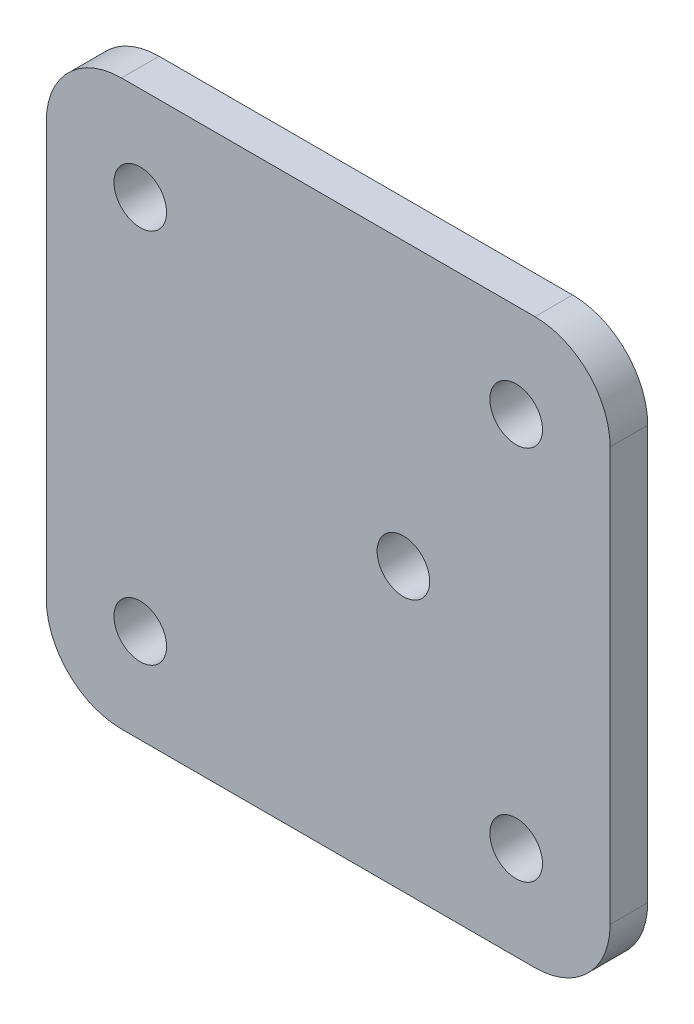
ISO-10303-21;
HEADER;
FILE_DESCRIPTION(('STEP AP214'),'2;1');
FILE_NAME('part.step','',(''),(''),'','','');
FILE_SCHEMA(('AUTOMOTIVE_DESIGN { 1 0 10303 214 1 1 1 1 }'));
ENDSEC;
DATA;
#1=APPLICATION_CONTEXT('core data for automotive mechanical design processes');
#2=APPLICATION_PROTOCOL_DEFINITION('international standard','automotive_design',2000,#1);
#3=PRODUCT_CONTEXT('',#1,'mechanical');
#4=PRODUCT('Part','Part','',(#3));
#5=PRODUCT_RELATED_PRODUCT_CATEGORY('part','',(#4));
#6=PRODUCT_DEFINITION_FORMATION('','',#4);
#7=PRODUCT_DEFINITION_CONTEXT('part definition',#1,'design');
#8=PRODUCT_DEFINITION('design','',#6,#7);
#9=PRODUCT_DEFINITION_SHAPE('','',#8);
#10=(LENGTH_UNIT() NAMED_UNIT(*) SI_UNIT(.MILLI.,.METRE.));
#11=(NAMED_UNIT(*) PLANE_ANGLE_UNIT() SI_UNIT($,.RADIAN.));
#12=(NAMED_UNIT(*) SI_UNIT($,.STERADIAN.) SOLID_ANGLE_UNIT());
#13=UNCERTAINTY_MEASURE_WITH_UNIT(LENGTH_MEASURE(1.E-05),#10,'distance_accuracy_value','');
#14=(GEOMETRIC_REPRESENTATION_CONTEXT(3) GLOBAL_UNCERTAINTY_ASSIGNED_CONTEXT((#13)) GLOBAL_UNIT_ASSIGNED_CONTEXT((#10,
#11,#12)) REPRESENTATION_CONTEXT('',''));
#15=CARTESIAN_POINT('',(0.,0.,0.));
#16=DIRECTION('',(0.,0.,1.));
#17=DIRECTION('',(1.,0.,0.));
#18=AXIS2_PLACEMENT_3D('',#15,#16,#17);
#19=CARTESIAN_POINT('',(-37.5,37.5,5.));
#20=DIRECTION('',(1.,0.,0.));
#21=DIRECTION('',(0.,1.,0.));
#22=AXIS2_PLACEMENT_3D('',#19,#20,#21);
#23=PLANE('',#22);
#24=DIRECTION('',(0.,-1.,0.));
#25=VECTOR('',#24,1.);
#26=CARTESIAN_POINT('',(-37.5,37.5,5.));
#27=LINE('',#26,#25);
#28=CARTESIAN_POINT('',(-37.5,27.5,5.));
#29=VERTEX_POINT('',#28);
#30=CARTESIAN_POINT('',(-37.5,-27.5,5.));
#31=VERTEX_POINT('',#30);
#32=EDGE_CURVE('E121',#29,#31,#27,.T.);
#33=ORIENTED_EDGE('',*,*,#32,.F.);
#34=DIRECTION('',(0.,0.,-1.));
#35=VECTOR('',#34,1.);
#36=CARTESIAN_POINT('',(-37.5,27.5,5.));
#37=LINE('',#36,#35);
#38=CARTESIAN_POINT('',(-37.5,27.5,0.));
#39=VERTEX_POINT('',#38);
#40=EDGE_CURVE('E106',#29,#39,#37,.T.);
#41=ORIENTED_EDGE('',*,*,#40,.T.);
#42=DIRECTION('',(0.,-1.,0.));
#43=VECTOR('',#42,1.);
#44=CARTESIAN_POINT('',(-37.5,37.5,0.));
#45=LINE('',#44,#43);
#46=CARTESIAN_POINT('',(-37.5,-27.5,0.));
#47=VERTEX_POINT('',#46);
#48=EDGE_CURVE('E118',#39,#47,#45,.T.);
#49=ORIENTED_EDGE('',*,*,#48,.T.);
#50=DIRECTION('',(0.,0.,-1.));
#51=VECTOR('',#50,1.);
#52=CARTESIAN_POINT('',(-37.5,-27.5,5.));
#53=LINE('',#52,#51);
#54=EDGE_CURVE('E123',#47,#31,#53,.F.);
#55=ORIENTED_EDGE('',*,*,#54,.T.);
#56=EDGE_LOOP('',(#33,#41,#49,#55));
#57=FACE_BOUND('',#56,.T.);
#58=ADVANCED_FACE('F36',(#57),#23,.F.);
#59=CARTESIAN_POINT('',(-37.5,-37.5,5.));
#60=DIRECTION('',(0.,1.,0.));
#61=DIRECTION('',(-1.,0.,0.));
#62=AXIS2_PLACEMENT_3D('',#59,#60,#61);
#63=PLANE('',#62);
#64=DIRECTION('',(1.,0.,0.));
#65=VECTOR('',#64,1.);
#66=CARTESIAN_POINT('',(-37.5,-37.5,5.));
#67=LINE('',#66,#65);
#68=CARTESIAN_POINT('',(-27.5,-37.5,5.));
#69=VERTEX_POINT('',#68);
#70=CARTESIAN_POINT('',(27.5,-37.5,5.));
#71=VERTEX_POINT('',#70);
#72=EDGE_CURVE('E167',#69,#71,#67,.T.);
#73=ORIENTED_EDGE('',*,*,#72,.F.);
#74=DIRECTION('',(0.,0.,-1.));
#75=VECTOR('',#74,1.);
#76=CARTESIAN_POINT('',(-27.5,-37.5,5.));
#77=LINE('',#76,#75);
#78=CARTESIAN_POINT('',(-27.5,-37.5,0.));
#79=VERTEX_POINT('',#78);
#80=EDGE_CURVE('E160',#69,#79,#77,.T.);
#81=ORIENTED_EDGE('',*,*,#80,.T.);
#82=DIRECTION('',(1.,0.,0.));
#83=VECTOR('',#82,1.);
#84=CARTESIAN_POINT('',(-37.5,-37.5,0.));
#85=LINE('',#84,#83);
#86=CARTESIAN_POINT('',(27.5,-37.5,0.));
#87=VERTEX_POINT('',#86);
#88=EDGE_CURVE('E127',#79,#87,#85,.T.);
#89=ORIENTED_EDGE('',*,*,#88,.T.);
#90=DIRECTION('',(0.,0.,-1.));
#91=VECTOR('',#90,1.);
#92=CARTESIAN_POINT('',(27.5,-37.5,5.));
#93=LINE('',#92,#91);
#94=EDGE_CURVE('E158',#87,#71,#93,.F.);
#95=ORIENTED_EDGE('',*,*,#94,.T.);
#96=EDGE_LOOP('',(#73,#81,#89,#95));
#97=FACE_BOUND('',#96,.T.);
#98=ADVANCED_FACE('F165',(#97),#63,.F.);
#99=CARTESIAN_POINT('',(37.5,37.5,5.));
#100=DIRECTION('',(-1.,0.,0.));
#101=DIRECTION('',(0.,0.,1.));
#102=AXIS2_PLACEMENT_3D('',#99,#100,#101);
#103=PLANE('',#102);
#104=DIRECTION('',(0.,1.,0.));
#105=VECTOR('',#104,1.);
#106=CARTESIAN_POINT('',(37.5,37.5,5.));
#107=LINE('',#106,#105);
#108=CARTESIAN_POINT('',(37.5,-27.5,5.));
#109=VERTEX_POINT('',#108);
#110=CARTESIAN_POINT('',(37.5,27.5,5.));
#111=VERTEX_POINT('',#110);
#112=EDGE_CURVE('E175',#109,#111,#107,.T.);
#113=ORIENTED_EDGE('',*,*,#112,.F.);
#114=DIRECTION('',(0.,0.,-1.));
#115=VECTOR('',#114,1.);
#116=CARTESIAN_POINT('',(37.5,-27.5,5.));
#117=LINE('',#116,#115);
#118=CARTESIAN_POINT('',(37.5,-27.5,0.));
#119=VERTEX_POINT('',#118);
#120=EDGE_CURVE('E11',#109,#119,#117,.T.);
#121=ORIENTED_EDGE('',*,*,#120,.T.);
#122=DIRECTION('',(0.,1.,0.));
#123=VECTOR('',#122,1.);
#124=CARTESIAN_POINT('',(37.5,37.5,0.));
#125=LINE('',#124,#123);
#126=CARTESIAN_POINT('',(37.5,27.5,0.));
#127=VERTEX_POINT('',#126);
#128=EDGE_CURVE('E131',#119,#127,#125,.T.);
#129=ORIENTED_EDGE('',*,*,#128,.T.);
#130=DIRECTION('',(0.,0.,-1.));
#131=VECTOR('',#130,1.);
#132=CARTESIAN_POINT('',(37.5,27.5,5.));
#133=LINE('',#132,#131);
#134=EDGE_CURVE('E44',#127,#111,#133,.F.);
#135=ORIENTED_EDGE('',*,*,#134,.T.);
#136=EDGE_LOOP('',(#113,#121,#129,#135));
#137=FACE_BOUND('',#136,.T.);
#138=ADVANCED_FACE('F174',(#137),#103,.F.);
#139=CARTESIAN_POINT('',(-37.5,37.5,5.));
#140=DIRECTION('',(0.,-1.,0.));
#141=DIRECTION('',(1.,0.,0.));
#142=AXIS2_PLACEMENT_3D('',#139,#140,#141);
#143=PLANE('',#142);
#144=DIRECTION('',(-1.,0.,0.));
#145=VECTOR('',#144,1.);
#146=CARTESIAN_POINT('',(-37.5,37.5,0.));
#147=LINE('',#146,#145);
#148=CARTESIAN_POINT('',(27.5,37.5,0.));
#149=VERTEX_POINT('',#148);
#150=CARTESIAN_POINT('',(-27.5,37.5,0.));
#151=VERTEX_POINT('',#150);
#152=EDGE_CURVE('E141',#149,#151,#147,.T.);
#153=ORIENTED_EDGE('',*,*,#152,.T.);
#154=DIRECTION('',(0.,0.,-1.));
#155=VECTOR('',#154,1.);
#156=CARTESIAN_POINT('',(-27.5,37.5,5.));
#157=LINE('',#156,#155);
#158=CARTESIAN_POINT('',(-27.5,37.5,5.));
#159=VERTEX_POINT('',#158);
#160=EDGE_CURVE('E107',#151,#159,#157,.F.);
#161=ORIENTED_EDGE('',*,*,#160,.T.);
#162=DIRECTION('',(-1.,0.,0.));
#163=VECTOR('',#162,1.);
#164=CARTESIAN_POINT('',(-37.5,37.5,5.));
#165=LINE('',#164,#163);
#166=CARTESIAN_POINT('',(27.5,37.5,5.));
#167=VERTEX_POINT('',#166);
#168=EDGE_CURVE('E137',#167,#159,#165,.T.);
#169=ORIENTED_EDGE('',*,*,#168,.F.);
#170=DIRECTION('',(0.,0.,-1.));
#171=VECTOR('',#170,1.);
#172=CARTESIAN_POINT('',(27.5,37.5,5.));
#173=LINE('',#172,#171);
#174=EDGE_CURVE('E112',#167,#149,#173,.T.);
#175=ORIENTED_EDGE('',*,*,#174,.T.);
#176=EDGE_LOOP('',(#153,#161,#169,#175));
#177=FACE_BOUND('',#176,.T.);
#178=ADVANCED_FACE('F213',(#177),#143,.F.);
#179=CARTESIAN_POINT('',(0.,0.,5.));
#180=DIRECTION('',(0.,0.,1.));
#181=DIRECTION('',(1.,0.,0.));
#182=AXIS2_PLACEMENT_3D('',#179,#180,#181);
#183=PLANE('',#182);
#184=CARTESIAN_POINT('',(10.,0.,5.));
#185=DIRECTION('',(0.,0.,1.));
#186=DIRECTION('',(1.,0.,0.));
#187=AXIS2_PLACEMENT_3D('',#184,#185,#186);
#188=CIRCLE('',#187,3.5);
#189=CARTESIAN_POINT('',(13.5,0.,5.));
#190=VERTEX_POINT('',#189);
#191=EDGE_CURVE('E204',#190,#190,#188,.T.);
#192=ORIENTED_EDGE('',*,*,#191,.F.);
#193=EDGE_LOOP('',(#192));
#194=FACE_BOUND('',#193,.T.);
#195=CARTESIAN_POINT('',(-25.,25.,5.));
#196=DIRECTION('',(0.,0.,1.));
#197=DIRECTION('',(1.,0.,0.));
#198=AXIS2_PLACEMENT_3D('',#195,#196,#197);
#199=CIRCLE('',#198,3.5);
#200=CARTESIAN_POINT('',(-21.5,25.,5.));
#201=VERTEX_POINT('',#200);
#202=EDGE_CURVE('E198',#201,#201,#199,.T.);
#203=ORIENTED_EDGE('',*,*,#202,.F.);
#204=EDGE_LOOP('',(#203));
#205=FACE_BOUND('',#204,.T.);
#206=CARTESIAN_POINT('',(-25.,-25.,5.));
#207=DIRECTION('',(0.,0.,1.));
#208=DIRECTION('',(1.,0.,0.));
#209=AXIS2_PLACEMENT_3D('',#206,#207,#208);
#210=CIRCLE('',#209,3.5);
#211=CARTESIAN_POINT('',(-21.5,-25.,5.));
#212=VERTEX_POINT('',#211);
#213=EDGE_CURVE('E192',#212,#212,#210,.T.);
#214=ORIENTED_EDGE('',*,*,#213,.F.);
#215=EDGE_LOOP('',(#214));
#216=FACE_BOUND('',#215,.T.);
#217=CARTESIAN_POINT('',(25.,-25.,5.));
#218=DIRECTION('',(0.,0.,1.));
#219=DIRECTION('',(1.,0.,0.));
#220=AXIS2_PLACEMENT_3D('',#217,#218,#219);
#221=CIRCLE('',#220,3.5);
#222=CARTESIAN_POINT('',(28.5,-25.,5.));
#223=VERTEX_POINT('',#222);
#224=EDGE_CURVE('E186',#223,#223,#221,.T.);
#225=ORIENTED_EDGE('',*,*,#224,.F.);
#226=EDGE_LOOP('',(#225));
#227=FACE_BOUND('',#226,.T.);
#228=CARTESIAN_POINT('',(25.,25.,5.));
#229=DIRECTION('',(0.,0.,1.));
#230=DIRECTION('',(1.,0.,0.));
#231=AXIS2_PLACEMENT_3D('',#228,#229,#230);
#232=CIRCLE('',#231,3.5);
#233=CARTESIAN_POINT('',(28.5,25.,5.));
#234=VERTEX_POINT('',#233);
#235=EDGE_CURVE('E134',#234,#234,#232,.T.);
#236=ORIENTED_EDGE('',*,*,#235,.F.);
#237=EDGE_LOOP('',(#236));
#238=FACE_BOUND('',#237,.T.);
#239=ORIENTED_EDGE('',*,*,#168,.T.);
#240=CARTESIAN_POINT('',(-27.5,27.5,5.));
#241=DIRECTION('',(0.,0.,1.));
#242=DIRECTION('',(1.,0.,0.));
#243=AXIS2_PLACEMENT_3D('',#240,#241,#242);
#244=CIRCLE('',#243,10.);
#245=EDGE_CURVE('E156',#159,#29,#244,.T.);
#246=ORIENTED_EDGE('',*,*,#245,.T.);
#247=ORIENTED_EDGE('',*,*,#32,.T.);
#248=CARTESIAN_POINT('',(-27.5,-27.5,5.));
#249=DIRECTION('',(0.,0.,1.));
#250=DIRECTION('',(1.,0.,0.));
#251=AXIS2_PLACEMENT_3D('',#248,#249,#250);
#252=CIRCLE('',#251,10.);
#253=EDGE_CURVE('E154',#31,#69,#252,.T.);
#254=ORIENTED_EDGE('',*,*,#253,.T.);
#255=ORIENTED_EDGE('',*,*,#72,.T.);
#256=CARTESIAN_POINT('',(27.5,-27.5,5.));
#257=DIRECTION('',(0.,0.,1.));
#258=DIRECTION('',(1.,0.,0.));
#259=AXIS2_PLACEMENT_3D('',#256,#257,#258);
#260=CIRCLE('',#259,10.);
#261=EDGE_CURVE('E57',#71,#109,#260,.T.);
#262=ORIENTED_EDGE('',*,*,#261,.T.);
#263=ORIENTED_EDGE('',*,*,#112,.T.);
#264=CARTESIAN_POINT('',(27.5,27.5,5.));
#265=DIRECTION('',(0.,0.,1.));
#266=DIRECTION('',(1.,0.,0.));
#267=AXIS2_PLACEMENT_3D('',#264,#265,#266);
#268=CIRCLE('',#267,10.);
#269=EDGE_CURVE('E151',#111,#167,#268,.T.);
#270=ORIENTED_EDGE('',*,*,#269,.T.);
#271=EDGE_LOOP('',(#239,#246,#247,#254,#255,#262,#263,#270));
#272=FACE_BOUND('',#271,.T.);
#273=ADVANCED_FACE('F210',(#194,#205,#216,#227,#238,#272),#183,.T.);
#274=CARTESIAN_POINT('',(0.,0.,0.));
#275=DIRECTION('',(0.,0.,1.));
#276=DIRECTION('',(1.,0.,0.));
#277=AXIS2_PLACEMENT_3D('',#274,#275,#276);
#278=PLANE('',#277);
#279=CARTESIAN_POINT('',(10.,0.,0.));
#280=DIRECTION('',(0.,0.,1.));
#281=DIRECTION('',(1.,0.,0.));
#282=AXIS2_PLACEMENT_3D('',#279,#280,#281);
#283=CIRCLE('',#282,3.5);
#284=CARTESIAN_POINT('',(13.5,0.,0.));
#285=VERTEX_POINT('',#284);
#286=EDGE_CURVE('E201',#285,#285,#283,.T.);
#287=ORIENTED_EDGE('',*,*,#286,.T.);
#288=EDGE_LOOP('',(#287));
#289=FACE_BOUND('',#288,.T.);
#290=CARTESIAN_POINT('',(-25.,25.,0.));
#291=DIRECTION('',(0.,0.,1.));
#292=DIRECTION('',(1.,0.,0.));
#293=AXIS2_PLACEMENT_3D('',#290,#291,#292);
#294=CIRCLE('',#293,3.5);
#295=CARTESIAN_POINT('',(-21.5,25.,0.));
#296=VERTEX_POINT('',#295);
#297=EDGE_CURVE('E195',#296,#296,#294,.T.);
#298=ORIENTED_EDGE('',*,*,#297,.T.);
#299=EDGE_LOOP('',(#298));
#300=FACE_BOUND('',#299,.T.);
#301=CARTESIAN_POINT('',(-25.,-25.,0.));
#302=DIRECTION('',(0.,0.,1.));
#303=DIRECTION('',(1.,0.,0.));
#304=AXIS2_PLACEMENT_3D('',#301,#302,#303);
#305=CIRCLE('',#304,3.5);
#306=CARTESIAN_POINT('',(-21.5,-25.,0.));
#307=VERTEX_POINT('',#306);
#308=EDGE_CURVE('E189',#307,#307,#305,.T.);
#309=ORIENTED_EDGE('',*,*,#308,.T.);
#310=EDGE_LOOP('',(#309));
#311=FACE_BOUND('',#310,.T.);
#312=CARTESIAN_POINT('',(25.,-25.,0.));
#313=DIRECTION('',(0.,0.,1.));
#314=DIRECTION('',(1.,0.,0.));
#315=AXIS2_PLACEMENT_3D('',#312,#313,#314);
#316=CIRCLE('',#315,3.5);
#317=CARTESIAN_POINT('',(28.5,-25.,0.));
#318=VERTEX_POINT('',#317);
#319=EDGE_CURVE('E183',#318,#318,#316,.T.);
#320=ORIENTED_EDGE('',*,*,#319,.T.);
#321=EDGE_LOOP('',(#320));
#322=FACE_BOUND('',#321,.T.);
#323=CARTESIAN_POINT('',(25.,25.,0.));
#324=DIRECTION('',(0.,0.,1.));
#325=DIRECTION('',(1.,0.,0.));
#326=AXIS2_PLACEMENT_3D('',#323,#324,#325);
#327=CIRCLE('',#326,3.5);
#328=CARTESIAN_POINT('',(28.5,25.,0.));
#329=VERTEX_POINT('',#328);
#330=EDGE_CURVE('E128',#329,#329,#327,.T.);
#331=ORIENTED_EDGE('',*,*,#330,.T.);
#332=EDGE_LOOP('',(#331));
#333=FACE_BOUND('',#332,.T.);
#334=ORIENTED_EDGE('',*,*,#48,.F.);
#335=CARTESIAN_POINT('',(-27.5,27.5,0.));
#336=DIRECTION('',(0.,0.,1.));
#337=DIRECTION('',(1.,0.,0.));
#338=AXIS2_PLACEMENT_3D('',#335,#336,#337);
#339=CIRCLE('',#338,10.);
#340=EDGE_CURVE('E102',#39,#151,#339,.F.);
#341=ORIENTED_EDGE('',*,*,#340,.T.);
#342=ORIENTED_EDGE('',*,*,#152,.F.);
#343=CARTESIAN_POINT('',(27.5,27.5,0.));
#344=DIRECTION('',(0.,0.,1.));
#345=DIRECTION('',(1.,0.,0.));
#346=AXIS2_PLACEMENT_3D('',#343,#344,#345);
#347=CIRCLE('',#346,10.);
#348=EDGE_CURVE('E122',#149,#127,#347,.F.);
#349=ORIENTED_EDGE('',*,*,#348,.T.);
#350=ORIENTED_EDGE('',*,*,#128,.F.);
#351=CARTESIAN_POINT('',(27.5,-27.5,0.));
#352=DIRECTION('',(0.,0.,1.));
#353=DIRECTION('',(1.,0.,0.));
#354=AXIS2_PLACEMENT_3D('',#351,#352,#353);
#355=CIRCLE('',#354,10.);
#356=EDGE_CURVE('E145',#119,#87,#355,.F.);
#357=ORIENTED_EDGE('',*,*,#356,.T.);
#358=ORIENTED_EDGE('',*,*,#88,.F.);
#359=CARTESIAN_POINT('',(-27.5,-27.5,0.));
#360=DIRECTION('',(0.,0.,1.));
#361=DIRECTION('',(1.,0.,0.));
#362=AXIS2_PLACEMENT_3D('',#359,#360,#361);
#363=CIRCLE('',#362,10.);
#364=EDGE_CURVE('E113',#79,#47,#363,.F.);
#365=ORIENTED_EDGE('',*,*,#364,.T.);
#366=EDGE_LOOP('',(#334,#341,#342,#349,#350,#357,#358,#365));
#367=FACE_BOUND('',#366,.T.);
#368=ADVANCED_FACE('F125',(#289,#300,#311,#322,#333,#367),#278,.F.);
#369=CARTESIAN_POINT('',(25.,25.,5.));
#370=DIRECTION('',(0.,0.,1.));
#371=DIRECTION('',(1.,0.,0.));
#372=AXIS2_PLACEMENT_3D('',#369,#370,#371);
#373=CYLINDRICAL_SURFACE('',#372,3.5);
#374=ORIENTED_EDGE('',*,*,#330,.F.);
#375=EDGE_LOOP('',(#374));
#376=FACE_BOUND('',#375,.T.);
#377=ORIENTED_EDGE('',*,*,#235,.T.);
#378=EDGE_LOOP('',(#377));
#379=FACE_BOUND('',#378,.T.);
#380=ADVANCED_FACE('F277',(#376,#379),#373,.F.);
#381=CARTESIAN_POINT('',(25.,-25.,5.));
#382=DIRECTION('',(0.,0.,1.));
#383=DIRECTION('',(1.,0.,0.));
#384=AXIS2_PLACEMENT_3D('',#381,#382,#383);
#385=CYLINDRICAL_SURFACE('',#384,3.5);
#386=ORIENTED_EDGE('',*,*,#319,.F.);
#387=EDGE_LOOP('',(#386));
#388=FACE_BOUND('',#387,.T.);
#389=ORIENTED_EDGE('',*,*,#224,.T.);
#390=EDGE_LOOP('',(#389));
#391=FACE_BOUND('',#390,.T.);
#392=ADVANCED_FACE('F292',(#388,#391),#385,.F.);
#393=CARTESIAN_POINT('',(-25.,-25.,5.));
#394=DIRECTION('',(0.,0.,1.));
#395=DIRECTION('',(1.,0.,0.));
#396=AXIS2_PLACEMENT_3D('',#393,#394,#395);
#397=CYLINDRICAL_SURFACE('',#396,3.5);
#398=ORIENTED_EDGE('',*,*,#308,.F.);
#399=EDGE_LOOP('',(#398));
#400=FACE_BOUND('',#399,.T.);
#401=ORIENTED_EDGE('',*,*,#213,.T.);
#402=EDGE_LOOP('',(#401));
#403=FACE_BOUND('',#402,.T.);
#404=ADVANCED_FACE('F299',(#400,#403),#397,.F.);
#405=CARTESIAN_POINT('',(-25.,25.,5.));
#406=DIRECTION('',(0.,0.,1.));
#407=DIRECTION('',(1.,0.,0.));
#408=AXIS2_PLACEMENT_3D('',#405,#406,#407);
#409=CYLINDRICAL_SURFACE('',#408,3.5);
#410=ORIENTED_EDGE('',*,*,#297,.F.);
#411=EDGE_LOOP('',(#410));
#412=FACE_BOUND('',#411,.T.);
#413=ORIENTED_EDGE('',*,*,#202,.T.);
#414=EDGE_LOOP('',(#413));
#415=FACE_BOUND('',#414,.T.);
#416=ADVANCED_FACE('F244',(#412,#415),#409,.F.);
#417=CARTESIAN_POINT('',(-27.5,27.5,5.));
#418=DIRECTION('',(0.,0.,-1.));
#419=DIRECTION('',(-1.,0.,0.));
#420=AXIS2_PLACEMENT_3D('',#417,#418,#419);
#421=CYLINDRICAL_SURFACE('',#420,10.);
#422=ORIENTED_EDGE('',*,*,#245,.F.);
#423=ORIENTED_EDGE('',*,*,#160,.F.);
#424=ORIENTED_EDGE('',*,*,#340,.F.);
#425=ORIENTED_EDGE('',*,*,#40,.F.);
#426=EDGE_LOOP('',(#422,#423,#424,#425));
#427=FACE_BOUND('',#426,.T.);
#428=ADVANCED_FACE('F105',(#427),#421,.T.);
#429=CARTESIAN_POINT('',(-27.5,-27.5,5.));
#430=DIRECTION('',(0.,0.,-1.));
#431=DIRECTION('',(-1.,0.,0.));
#432=AXIS2_PLACEMENT_3D('',#429,#430,#431);
#433=CYLINDRICAL_SURFACE('',#432,10.);
#434=ORIENTED_EDGE('',*,*,#253,.F.);
#435=ORIENTED_EDGE('',*,*,#54,.F.);
#436=ORIENTED_EDGE('',*,*,#364,.F.);
#437=ORIENTED_EDGE('',*,*,#80,.F.);
#438=EDGE_LOOP('',(#434,#435,#436,#437));
#439=FACE_BOUND('',#438,.T.);
#440=ADVANCED_FACE('F233',(#439),#433,.T.);
#441=CARTESIAN_POINT('',(27.5,-27.5,5.));
#442=DIRECTION('',(0.,0.,-1.));
#443=DIRECTION('',(-1.,0.,0.));
#444=AXIS2_PLACEMENT_3D('',#441,#442,#443);
#445=CYLINDRICAL_SURFACE('',#444,10.);
#446=ORIENTED_EDGE('',*,*,#261,.F.);
#447=ORIENTED_EDGE('',*,*,#94,.F.);
#448=ORIENTED_EDGE('',*,*,#356,.F.);
#449=ORIENTED_EDGE('',*,*,#120,.F.);
#450=EDGE_LOOP('',(#446,#447,#448,#449));
#451=FACE_BOUND('',#450,.T.);
#452=ADVANCED_FACE('F173',(#451),#445,.T.);
#453=CARTESIAN_POINT('',(27.5,27.5,5.));
#454=DIRECTION('',(0.,0.,-1.));
#455=DIRECTION('',(-1.,0.,0.));
#456=AXIS2_PLACEMENT_3D('',#453,#454,#455);
#457=CYLINDRICAL_SURFACE('',#456,10.);
#458=ORIENTED_EDGE('',*,*,#269,.F.);
#459=ORIENTED_EDGE('',*,*,#134,.F.);
#460=ORIENTED_EDGE('',*,*,#348,.F.);
#461=ORIENTED_EDGE('',*,*,#174,.F.);
#462=EDGE_LOOP('',(#458,#459,#460,#461));
#463=FACE_BOUND('',#462,.T.);
#464=ADVANCED_FACE('F38',(#463),#457,.T.);
#465=CARTESIAN_POINT('',(10.,0.,5.));
#466=DIRECTION('',(0.,0.,1.));
#467=DIRECTION('',(1.,0.,0.));
#468=AXIS2_PLACEMENT_3D('',#465,#466,#467);
#469=CYLINDRICAL_SURFACE('',#468,3.5);
#470=ORIENTED_EDGE('',*,*,#286,.F.);
#471=EDGE_LOOP('',(#470));
#472=FACE_BOUND('',#471,.T.);
#473=ORIENTED_EDGE('',*,*,#191,.T.);
#474=EDGE_LOOP('',(#473));
#475=FACE_BOUND('',#474,.T.);
#476=ADVANCED_FACE('F208',(#472,#475),#469,.F.);
#477=CLOSED_SHELL('',(#58,#98,#138,#178,#273,#368,#380,#392,#404,#416,#428,#440,#452,#464,#476));
#478=MANIFOLD_SOLID_BREP('B2',#477);
#479=ADVANCED_BREP_SHAPE_REPRESENTATION('',(#18,#478),#14);
#480=SHAPE_DEFINITION_REPRESENTATION(#9,#479);
ENDSEC;
END-ISO-10303-21;
